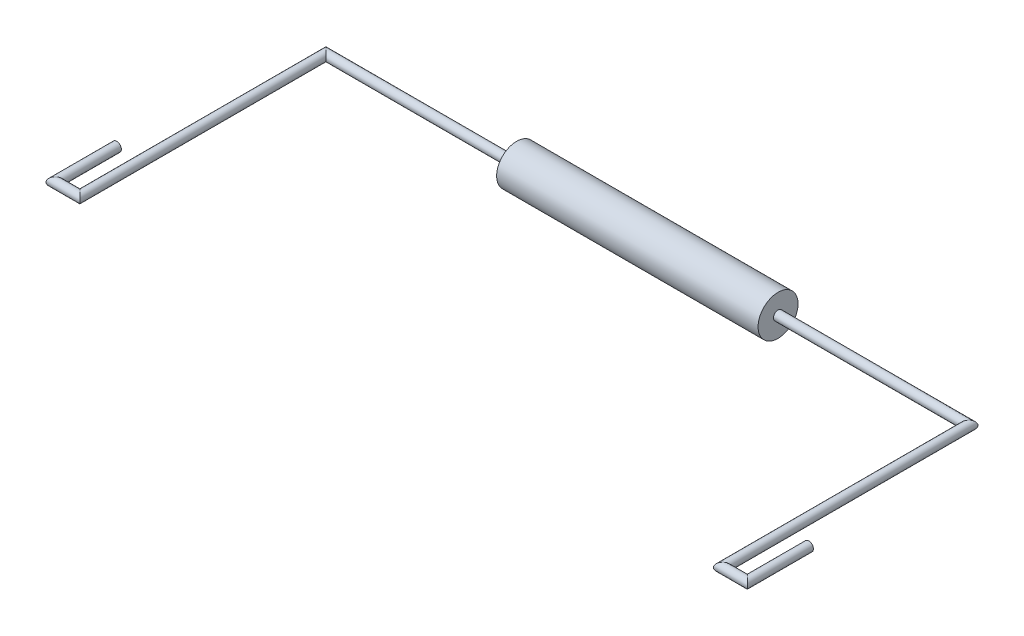
ISO-10303-21;
HEADER;
FILE_DESCRIPTION(('STEP AP214'),'2;1');
FILE_NAME('part.step','',(''),(''),'','','');
FILE_SCHEMA(('AUTOMOTIVE_DESIGN { 1 0 10303 214 1 1 1 1 }'));
ENDSEC;
DATA;
#1=APPLICATION_CONTEXT('core data for automotive mechanical design processes');
#2=APPLICATION_PROTOCOL_DEFINITION('international standard','automotive_design',2000,#1);
#3=PRODUCT_CONTEXT('',#1,'mechanical');
#4=PRODUCT('Part','Part','',(#3));
#5=PRODUCT_RELATED_PRODUCT_CATEGORY('part','',(#4));
#6=PRODUCT_DEFINITION_FORMATION('','',#4);
#7=PRODUCT_DEFINITION_CONTEXT('part definition',#1,'design');
#8=PRODUCT_DEFINITION('design','',#6,#7);
#9=PRODUCT_DEFINITION_SHAPE('','',#8);
#10=(LENGTH_UNIT() NAMED_UNIT(*) SI_UNIT(.MILLI.,.METRE.));
#11=(NAMED_UNIT(*) PLANE_ANGLE_UNIT() SI_UNIT($,.RADIAN.));
#12=(NAMED_UNIT(*) SI_UNIT($,.STERADIAN.) SOLID_ANGLE_UNIT());
#13=UNCERTAINTY_MEASURE_WITH_UNIT(LENGTH_MEASURE(1.E-05),#10,'distance_accuracy_value','');
#14=(GEOMETRIC_REPRESENTATION_CONTEXT(3) GLOBAL_UNCERTAINTY_ASSIGNED_CONTEXT((#13)) GLOBAL_UNIT_ASSIGNED_CONTEXT((#10,
#11,#12)) REPRESENTATION_CONTEXT('',''));
#15=CARTESIAN_POINT('',(0.,0.,0.));
#16=DIRECTION('',(0.,0.,1.));
#17=DIRECTION('',(1.,0.,0.));
#18=AXIS2_PLACEMENT_3D('',#15,#16,#17);
#19=CARTESIAN_POINT('',(106.25,0.,0.));
#20=DIRECTION('',(-1.,0.,0.));
#21=DIRECTION('',(0.,0.,1.));
#22=AXIS2_PLACEMENT_3D('',#19,#20,#21);
#23=CYLINDRICAL_SURFACE('',#22,1.5);
#24=CARTESIAN_POINT('',(-104.5,0.,0.));
#25=DIRECTION('',(0.707106781186548,0.,-0.707106781186547));
#26=DIRECTION('',(-0.707106781186547,0.,-0.707106781186548));
#27=AXIS2_PLACEMENT_3D('',#24,#25,#26);
#28=ELLIPSE('',#27,2.12132034355964,1.5);
#29=CARTESIAN_POINT('',(-106.,0.,-1.50000000000003));
#30=VERTEX_POINT('',#29);
#31=EDGE_CURVE('E58',#30,#30,#28,.T.);
#32=ORIENTED_EDGE('',*,*,#31,.T.);
#33=EDGE_LOOP('',(#32));
#34=FACE_BOUND('',#33,.T.);
#35=CARTESIAN_POINT('',(-42.5,0.,0.));
#36=DIRECTION('',(1.,0.,0.));
#37=DIRECTION('',(0.,0.,-1.));
#38=AXIS2_PLACEMENT_3D('',#35,#36,#37);
#39=CIRCLE('',#38,1.5);
#40=CARTESIAN_POINT('',(-42.5,0.,-1.49999999999999));
#41=VERTEX_POINT('',#40);
#42=EDGE_CURVE('E10',#41,#41,#39,.T.);
#43=ORIENTED_EDGE('',*,*,#42,.F.);
#44=EDGE_LOOP('',(#43));
#45=FACE_BOUND('',#44,.T.);
#46=ADVANCED_FACE('F31',(#34,#45),#23,.T.);
#47=CARTESIAN_POINT('',(-112.5,0.,60.));
#48=DIRECTION('',(0.,0.,-1.));
#49=DIRECTION('',(1.,0.,0.));
#50=AXIS2_PLACEMENT_3D('',#47,#48,#49);
#51=PLANE('',#50);
#52=CARTESIAN_POINT('',(-112.5,0.,60.));
#53=DIRECTION('',(0.,0.,1.));
#54=DIRECTION('',(1.,0.,0.));
#55=AXIS2_PLACEMENT_3D('',#52,#53,#54);
#56=CIRCLE('',#55,1.5);
#57=CARTESIAN_POINT('',(-111.,0.,60.));
#58=VERTEX_POINT('',#57);
#59=EDGE_CURVE('E72',#58,#58,#56,.F.);
#60=ORIENTED_EDGE('',*,*,#59,.T.);
#61=EDGE_LOOP('',(#60));
#62=FACE_BOUND('',#61,.T.);
#63=ADVANCED_FACE('F95',(#62),#51,.T.);
#64=CARTESIAN_POINT('',(-104.5,0.,81.75));
#65=DIRECTION('',(0.,0.,-1.));
#66=DIRECTION('',(-1.,0.,0.));
#67=AXIS2_PLACEMENT_3D('',#64,#65,#66);
#68=CYLINDRICAL_SURFACE('',#67,1.5);
#69=CARTESIAN_POINT('',(-104.5,0.,80.));
#70=DIRECTION('',(0.707106781186548,0.,-0.707106781186547));
#71=DIRECTION('',(0.707106781186547,0.,0.707106781186548));
#72=AXIS2_PLACEMENT_3D('',#69,#70,#71);
#73=ELLIPSE('',#72,2.12132034355964,1.5);
#74=CARTESIAN_POINT('',(-103.,0.,81.5));
#75=VERTEX_POINT('',#74);
#76=EDGE_CURVE('E63',#75,#75,#73,.T.);
#77=ORIENTED_EDGE('',*,*,#76,.T.);
#78=EDGE_LOOP('',(#77));
#79=FACE_BOUND('',#78,.T.);
#80=ORIENTED_EDGE('',*,*,#31,.F.);
#81=EDGE_LOOP('',(#80));
#82=FACE_BOUND('',#81,.T.);
#83=ADVANCED_FACE('F80',(#79,#82),#68,.T.);
#84=CARTESIAN_POINT('',(-114.25,0.,80.));
#85=DIRECTION('',(1.,0.,0.));
#86=DIRECTION('',(0.,0.,-1.));
#87=AXIS2_PLACEMENT_3D('',#84,#85,#86);
#88=CYLINDRICAL_SURFACE('',#87,1.5);
#89=CARTESIAN_POINT('',(-112.5,0.,80.));
#90=DIRECTION('',(0.707106781186547,0.,0.707106781186548));
#91=DIRECTION('',(-0.707106781186548,0.,0.707106781186547));
#92=AXIS2_PLACEMENT_3D('',#89,#90,#91);
#93=ELLIPSE('',#92,2.12132034355964,1.5);
#94=CARTESIAN_POINT('',(-114.,0.,81.5));
#95=VERTEX_POINT('',#94);
#96=EDGE_CURVE('E55',#95,#95,#93,.T.);
#97=ORIENTED_EDGE('',*,*,#96,.T.);
#98=EDGE_LOOP('',(#97));
#99=FACE_BOUND('',#98,.T.);
#100=ORIENTED_EDGE('',*,*,#76,.F.);
#101=EDGE_LOOP('',(#100));
#102=FACE_BOUND('',#101,.T.);
#103=ADVANCED_FACE('F83',(#99,#102),#88,.T.);
#104=CARTESIAN_POINT('',(-112.5,0.,60.));
#105=DIRECTION('',(0.,0.,1.));
#106=DIRECTION('',(1.,0.,0.));
#107=AXIS2_PLACEMENT_3D('',#104,#105,#106);
#108=CYLINDRICAL_SURFACE('',#107,1.5);
#109=ORIENTED_EDGE('',*,*,#59,.F.);
#110=EDGE_LOOP('',(#109));
#111=FACE_BOUND('',#110,.T.);
#112=ORIENTED_EDGE('',*,*,#96,.F.);
#113=EDGE_LOOP('',(#112));
#114=FACE_BOUND('',#113,.T.);
#115=ADVANCED_FACE('F85',(#111,#114),#108,.T.);
#116=CARTESIAN_POINT('',(-42.5,0.,0.));
#117=DIRECTION('',(1.,0.,0.));
#118=DIRECTION('',(0.,0.,-1.));
#119=AXIS2_PLACEMENT_3D('',#116,#117,#118);
#120=CYLINDRICAL_SURFACE('',#119,6.5);
#121=CARTESIAN_POINT('',(-42.5,0.,0.));
#122=DIRECTION('',(1.,0.,0.));
#123=DIRECTION('',(0.,0.,-1.));
#124=AXIS2_PLACEMENT_3D('',#121,#122,#123);
#125=CIRCLE('',#124,6.5);
#126=CARTESIAN_POINT('',(-42.5,0.,-6.5));
#127=VERTEX_POINT('',#126);
#128=EDGE_CURVE('E59',#127,#127,#125,.T.);
#129=ORIENTED_EDGE('',*,*,#128,.T.);
#130=EDGE_LOOP('',(#129));
#131=FACE_BOUND('',#130,.T.);
#132=CARTESIAN_POINT('',(42.5,0.,0.));
#133=DIRECTION('',(1.,0.,0.));
#134=DIRECTION('',(0.,0.,-1.));
#135=AXIS2_PLACEMENT_3D('',#132,#133,#134);
#136=CIRCLE('',#135,6.5);
#137=CARTESIAN_POINT('',(42.5,0.,-6.5));
#138=VERTEX_POINT('',#137);
#139=EDGE_CURVE('E65',#138,#138,#136,.T.);
#140=ORIENTED_EDGE('',*,*,#139,.F.);
#141=EDGE_LOOP('',(#140));
#142=FACE_BOUND('',#141,.T.);
#143=ADVANCED_FACE('F92',(#131,#142),#120,.T.);
#144=CARTESIAN_POINT('',(-42.5,0.,0.));
#145=DIRECTION('',(1.,0.,0.));
#146=DIRECTION('',(0.,0.,-1.));
#147=AXIS2_PLACEMENT_3D('',#144,#145,#146);
#148=PLANE('',#147);
#149=ORIENTED_EDGE('',*,*,#42,.T.);
#150=EDGE_LOOP('',(#149));
#151=FACE_BOUND('',#150,.T.);
#152=ORIENTED_EDGE('',*,*,#128,.F.);
#153=EDGE_LOOP('',(#152));
#154=FACE_BOUND('',#153,.T.);
#155=ADVANCED_FACE('F138',(#151,#154),#148,.F.);
#156=CARTESIAN_POINT('',(42.5,0.,0.));
#157=DIRECTION('',(1.,0.,0.));
#158=DIRECTION('',(0.,0.,-1.));
#159=AXIS2_PLACEMENT_3D('',#156,#157,#158);
#160=PLANE('',#159);
#161=CARTESIAN_POINT('',(42.5,0.,0.));
#162=DIRECTION('',(1.,0.,0.));
#163=DIRECTION('',(0.,0.,-1.));
#164=AXIS2_PLACEMENT_3D('',#161,#162,#163);
#165=CIRCLE('',#164,1.5);
#166=CARTESIAN_POINT('',(42.5,0.,-1.50000000000001));
#167=VERTEX_POINT('',#166);
#168=EDGE_CURVE('E56',#167,#167,#165,.T.);
#169=ORIENTED_EDGE('',*,*,#168,.F.);
#170=EDGE_LOOP('',(#169));
#171=FACE_BOUND('',#170,.T.);
#172=ORIENTED_EDGE('',*,*,#139,.T.);
#173=EDGE_LOOP('',(#172));
#174=FACE_BOUND('',#173,.T.);
#175=ADVANCED_FACE('F131',(#171,#174),#160,.T.);
#176=CARTESIAN_POINT('',(112.5,0.,60.));
#177=DIRECTION('',(0.,0.,-1.));
#178=DIRECTION('',(-1.,0.,0.));
#179=AXIS2_PLACEMENT_3D('',#176,#177,#178);
#180=PLANE('',#179);
#181=CARTESIAN_POINT('',(112.5,0.,60.));
#182=DIRECTION('',(0.,0.,-1.));
#183=DIRECTION('',(-1.,0.,0.));
#184=AXIS2_PLACEMENT_3D('',#181,#182,#183);
#185=CIRCLE('',#184,1.5);
#186=CARTESIAN_POINT('',(111.,0.,60.));
#187=VERTEX_POINT('',#186);
#188=EDGE_CURVE('E42',#187,#187,#185,.T.);
#189=ORIENTED_EDGE('',*,*,#188,.T.);
#190=EDGE_LOOP('',(#189));
#191=FACE_BOUND('',#190,.T.);
#192=ADVANCED_FACE('F33',(#191),#180,.T.);
#193=CARTESIAN_POINT('',(112.5,0.,60.));
#194=DIRECTION('',(0.,0.,1.));
#195=DIRECTION('',(1.,0.,0.));
#196=AXIS2_PLACEMENT_3D('',#193,#194,#195);
#197=CYLINDRICAL_SURFACE('',#196,1.5);
#198=ORIENTED_EDGE('',*,*,#188,.F.);
#199=EDGE_LOOP('',(#198));
#200=FACE_BOUND('',#199,.T.);
#201=CARTESIAN_POINT('',(112.5,0.,80.));
#202=DIRECTION('',(-0.707106781186547,0.,0.707106781186548));
#203=DIRECTION('',(0.707106781186548,0.,0.707106781186547));
#204=AXIS2_PLACEMENT_3D('',#201,#202,#203);
#205=ELLIPSE('',#204,2.12132034355964,1.5);
#206=CARTESIAN_POINT('',(114.,0.,81.5));
#207=VERTEX_POINT('',#206);
#208=EDGE_CURVE('E38',#207,#207,#205,.T.);
#209=ORIENTED_EDGE('',*,*,#208,.F.);
#210=EDGE_LOOP('',(#209));
#211=FACE_BOUND('',#210,.T.);
#212=ADVANCED_FACE('F123',(#200,#211),#197,.T.);
#213=CARTESIAN_POINT('',(114.25,0.,80.));
#214=DIRECTION('',(-1.,0.,0.));
#215=DIRECTION('',(0.,0.,1.));
#216=AXIS2_PLACEMENT_3D('',#213,#214,#215);
#217=CYLINDRICAL_SURFACE('',#216,1.5);
#218=ORIENTED_EDGE('',*,*,#208,.T.);
#219=EDGE_LOOP('',(#218));
#220=FACE_BOUND('',#219,.T.);
#221=CARTESIAN_POINT('',(104.5,0.,80.));
#222=DIRECTION('',(-0.707106781186548,0.,-0.707106781186547));
#223=DIRECTION('',(-0.707106781186547,0.,0.707106781186548));
#224=AXIS2_PLACEMENT_3D('',#221,#222,#223);
#225=ELLIPSE('',#224,2.12132034355964,1.5);
#226=CARTESIAN_POINT('',(103.,0.,81.5));
#227=VERTEX_POINT('',#226);
#228=EDGE_CURVE('E47',#227,#227,#225,.T.);
#229=ORIENTED_EDGE('',*,*,#228,.F.);
#230=EDGE_LOOP('',(#229));
#231=FACE_BOUND('',#230,.T.);
#232=ADVANCED_FACE('F115',(#220,#231),#217,.T.);
#233=CARTESIAN_POINT('',(104.5,0.,81.75));
#234=DIRECTION('',(0.,0.,-1.));
#235=DIRECTION('',(-1.,0.,0.));
#236=AXIS2_PLACEMENT_3D('',#233,#234,#235);
#237=CYLINDRICAL_SURFACE('',#236,1.5);
#238=ORIENTED_EDGE('',*,*,#228,.T.);
#239=EDGE_LOOP('',(#238));
#240=FACE_BOUND('',#239,.T.);
#241=CARTESIAN_POINT('',(104.5,0.,0.));
#242=DIRECTION('',(-0.707106781186548,0.,-0.707106781186547));
#243=DIRECTION('',(0.707106781186547,0.,-0.707106781186548));
#244=AXIS2_PLACEMENT_3D('',#241,#242,#243);
#245=ELLIPSE('',#244,2.12132034355964,1.5);
#246=CARTESIAN_POINT('',(106.,0.,-1.50000000000003));
#247=VERTEX_POINT('',#246);
#248=EDGE_CURVE('E53',#247,#247,#245,.T.);
#249=ORIENTED_EDGE('',*,*,#248,.F.);
#250=EDGE_LOOP('',(#249));
#251=FACE_BOUND('',#250,.T.);
#252=ADVANCED_FACE('F110',(#240,#251),#237,.T.);
#253=ORIENTED_EDGE('',*,*,#168,.T.);
#254=EDGE_LOOP('',(#253));
#255=FACE_BOUND('',#254,.T.);
#256=ORIENTED_EDGE('',*,*,#248,.T.);
#257=EDGE_LOOP('',(#256));
#258=FACE_BOUND('',#257,.T.);
#259=ADVANCED_FACE('F99',(#255,#258),#23,.T.);
#260=CLOSED_SHELL('',(#46,#63,#83,#103,#115,#143,#155,#175,#192,#212,#232,#252,#259));
#261=MANIFOLD_SOLID_BREP('B2',#260);
#262=ADVANCED_BREP_SHAPE_REPRESENTATION('',(#18,#261),#14);
#263=SHAPE_DEFINITION_REPRESENTATION(#9,#262);
ENDSEC;
END-ISO-10303-21;
